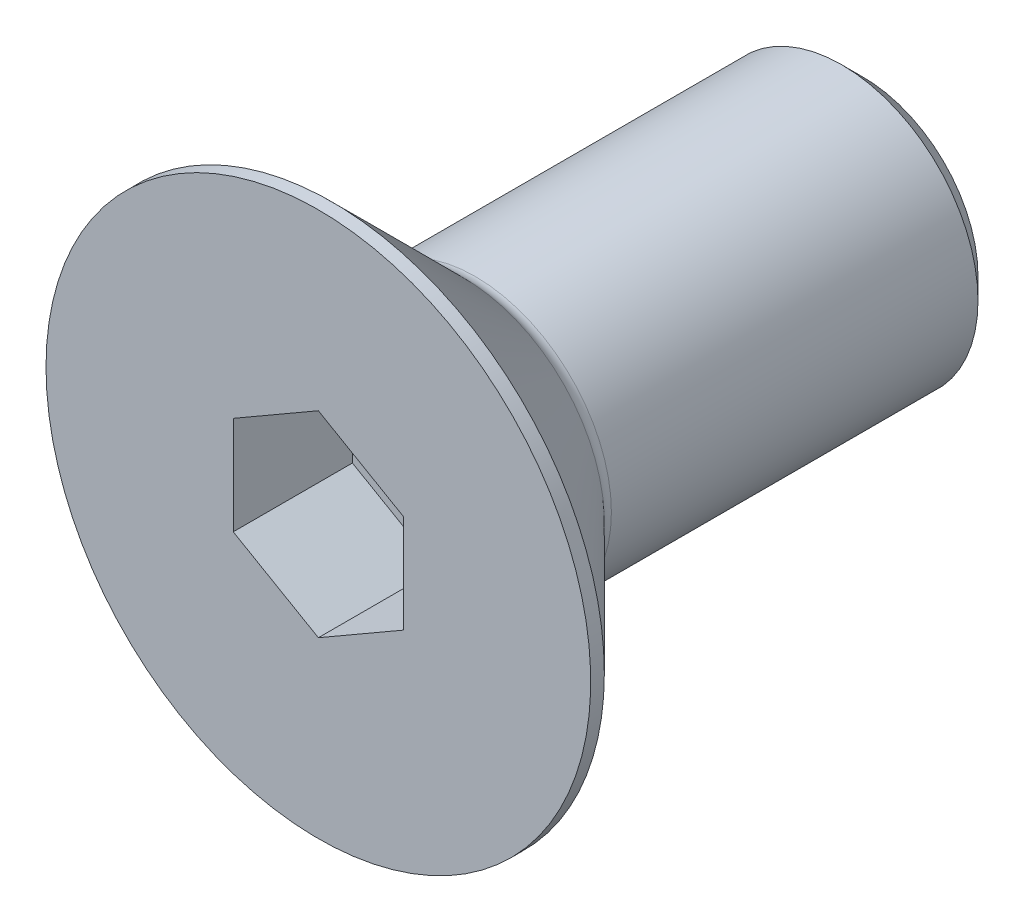
ISO-10303-21;
HEADER;
FILE_DESCRIPTION(('STEP AP214'),'2;1');
FILE_NAME('part.step','',(''),(''),'','','');
FILE_SCHEMA(('AUTOMOTIVE_DESIGN { 1 0 10303 214 1 1 1 1 }'));
ENDSEC;
DATA;
#1=APPLICATION_CONTEXT('core data for automotive mechanical design processes');
#2=APPLICATION_PROTOCOL_DEFINITION('international standard','automotive_design',2000,#1);
#3=PRODUCT_CONTEXT('',#1,'mechanical');
#4=PRODUCT('Part','Part','',(#3));
#5=PRODUCT_RELATED_PRODUCT_CATEGORY('part','',(#4));
#6=PRODUCT_DEFINITION_FORMATION('','',#4);
#7=PRODUCT_DEFINITION_CONTEXT('part definition',#1,'design');
#8=PRODUCT_DEFINITION('design','',#6,#7);
#9=PRODUCT_DEFINITION_SHAPE('','',#8);
#10=(LENGTH_UNIT() NAMED_UNIT(*) SI_UNIT(.MILLI.,.METRE.));
#11=(NAMED_UNIT(*) PLANE_ANGLE_UNIT() SI_UNIT($,.RADIAN.));
#12=(NAMED_UNIT(*) SI_UNIT($,.STERADIAN.) SOLID_ANGLE_UNIT());
#13=UNCERTAINTY_MEASURE_WITH_UNIT(LENGTH_MEASURE(1.E-05),#10,'distance_accuracy_value','');
#14=(GEOMETRIC_REPRESENTATION_CONTEXT(3) GLOBAL_UNCERTAINTY_ASSIGNED_CONTEXT((#13)) GLOBAL_UNIT_ASSIGNED_CONTEXT((#10,
#11,#12)) REPRESENTATION_CONTEXT('',''));
#15=CARTESIAN_POINT('',(0.,0.,0.));
#16=DIRECTION('',(0.,0.,1.));
#17=DIRECTION('',(1.,0.,0.));
#18=AXIS2_PLACEMENT_3D('',#15,#16,#17);
#19=CARTESIAN_POINT('',(0.,0.,-3.5));
#20=DIRECTION('',(0.,0.,1.));
#21=DIRECTION('',(1.,0.,0.));
#22=AXIS2_PLACEMENT_3D('',#19,#20,#21);
#23=PLANE('',#22);
#24=DIRECTION('',(-0.866025403784439,-0.5,0.));
#25=VECTOR('',#24,1.);
#26=CARTESIAN_POINT('',(0.,2.88675134594813,-3.5));
#27=LINE('',#26,#25);
#28=CARTESIAN_POINT('',(0.,2.88675134594813,-3.5));
#29=VERTEX_POINT('',#28);
#30=CARTESIAN_POINT('',(-2.5,1.44337567297406,-3.5));
#31=VERTEX_POINT('',#30);
#32=EDGE_CURVE('E82',#29,#31,#27,.T.);
#33=ORIENTED_EDGE('',*,*,#32,.T.);
#34=DIRECTION('',(0.,1.,0.));
#35=VECTOR('',#34,1.);
#36=CARTESIAN_POINT('',(-2.5,1.44337567297406,-3.5));
#37=LINE('',#36,#35);
#38=CARTESIAN_POINT('',(-2.5,-1.44337567297407,-3.5));
#39=VERTEX_POINT('',#38);
#40=EDGE_CURVE('E66',#31,#39,#37,.F.);
#41=ORIENTED_EDGE('',*,*,#40,.T.);
#42=DIRECTION('',(0.866025403784439,-0.499999999999999,0.));
#43=VECTOR('',#42,1.);
#44=CARTESIAN_POINT('',(-2.5,-1.44337567297407,-3.5));
#45=LINE('',#44,#43);
#46=CARTESIAN_POINT('',(0.,-2.88675134594813,-3.5));
#47=VERTEX_POINT('',#46);
#48=EDGE_CURVE('E71',#39,#47,#45,.T.);
#49=ORIENTED_EDGE('',*,*,#48,.T.);
#50=DIRECTION('',(0.866025403784439,0.5,0.));
#51=VECTOR('',#50,1.);
#52=CARTESIAN_POINT('',(0.,-2.88675134594813,-3.5));
#53=LINE('',#52,#51);
#54=CARTESIAN_POINT('',(2.5,-1.44337567297406,-3.5));
#55=VERTEX_POINT('',#54);
#56=EDGE_CURVE('E128',#47,#55,#53,.T.);
#57=ORIENTED_EDGE('',*,*,#56,.T.);
#58=DIRECTION('',(0.,1.,0.));
#59=VECTOR('',#58,1.);
#60=CARTESIAN_POINT('',(2.5,-1.44337567297406,-3.5));
#61=LINE('',#60,#59);
#62=CARTESIAN_POINT('',(2.5,1.44337567297407,-3.5));
#63=VERTEX_POINT('',#62);
#64=EDGE_CURVE('E132',#55,#63,#61,.T.);
#65=ORIENTED_EDGE('',*,*,#64,.T.);
#66=DIRECTION('',(-0.866025403784439,0.499999999999999,0.));
#67=VECTOR('',#66,1.);
#68=CARTESIAN_POINT('',(2.5,1.44337567297407,-3.5));
#69=LINE('',#68,#67);
#70=EDGE_CURVE('E137',#63,#29,#69,.T.);
#71=ORIENTED_EDGE('',*,*,#70,.T.);
#72=EDGE_LOOP('',(#33,#41,#49,#57,#65,#71));
#73=FACE_BOUND('',#72,.T.);
#74=ADVANCED_FACE('F15',(#73),#23,.T.);
#75=CARTESIAN_POINT('',(-2.5,-1.44337567297407,0.));
#76=DIRECTION('',(-0.499999999999999,-0.866025403784439,0.));
#77=DIRECTION('',(0.866025403784439,-0.499999999999999,0.));
#78=AXIS2_PLACEMENT_3D('',#75,#76,#77);
#79=PLANE('',#78);
#80=DIRECTION('',(0.,0.,1.));
#81=VECTOR('',#80,1.);
#82=CARTESIAN_POINT('',(-2.5,-1.44337567297407,0.));
#83=LINE('',#82,#81);
#84=CARTESIAN_POINT('',(-2.5,-1.44337567297407,0.));
#85=VERTEX_POINT('',#84);
#86=EDGE_CURVE('E73',#39,#85,#83,.T.);
#87=ORIENTED_EDGE('',*,*,#86,.T.);
#88=DIRECTION('',(-0.866025403784439,0.499999999999999,0.));
#89=VECTOR('',#88,1.);
#90=CARTESIAN_POINT('',(0.,-2.88675134594813,0.));
#91=LINE('',#90,#89);
#92=CARTESIAN_POINT('',(0.,-2.88675134594813,0.));
#93=VERTEX_POINT('',#92);
#94=EDGE_CURVE('E126',#93,#85,#91,.T.);
#95=ORIENTED_EDGE('',*,*,#94,.F.);
#96=DIRECTION('',(0.,0.,1.));
#97=VECTOR('',#96,1.);
#98=CARTESIAN_POINT('',(0.,-2.88675134594813,0.));
#99=LINE('',#98,#97);
#100=EDGE_CURVE('E76',#93,#47,#99,.F.);
#101=ORIENTED_EDGE('',*,*,#100,.T.);
#102=ORIENTED_EDGE('',*,*,#48,.F.);
#103=EDGE_LOOP('',(#87,#95,#101,#102));
#104=FACE_BOUND('',#103,.T.);
#105=ADVANCED_FACE('F72',(#104),#79,.F.);
#106=CARTESIAN_POINT('',(-2.5,1.44337567297406,0.));
#107=DIRECTION('',(-1.,0.,0.));
#108=DIRECTION('',(0.,0.,1.));
#109=AXIS2_PLACEMENT_3D('',#106,#107,#108);
#110=PLANE('',#109);
#111=DIRECTION('',(0.,0.,1.));
#112=VECTOR('',#111,1.);
#113=CARTESIAN_POINT('',(-2.5,1.44337567297406,0.));
#114=LINE('',#113,#112);
#115=CARTESIAN_POINT('',(-2.5,1.44337567297406,0.));
#116=VERTEX_POINT('',#115);
#117=EDGE_CURVE('E84',#31,#116,#114,.T.);
#118=ORIENTED_EDGE('',*,*,#117,.T.);
#119=DIRECTION('',(0.,1.,0.));
#120=VECTOR('',#119,1.);
#121=CARTESIAN_POINT('',(-2.5,0.,0.));
#122=LINE('',#121,#120);
#123=EDGE_CURVE('E88',#85,#116,#122,.T.);
#124=ORIENTED_EDGE('',*,*,#123,.F.);
#125=ORIENTED_EDGE('',*,*,#86,.F.);
#126=ORIENTED_EDGE('',*,*,#40,.F.);
#127=EDGE_LOOP('',(#118,#124,#125,#126));
#128=FACE_BOUND('',#127,.T.);
#129=ADVANCED_FACE('F86',(#128),#110,.F.);
#130=CARTESIAN_POINT('',(0.,2.88675134594813,0.));
#131=DIRECTION('',(-0.5,0.866025403784439,0.));
#132=DIRECTION('',(-0.866025403784439,-0.5,0.));
#133=AXIS2_PLACEMENT_3D('',#130,#131,#132);
#134=PLANE('',#133);
#135=DIRECTION('',(0.,0.,1.));
#136=VECTOR('',#135,1.);
#137=CARTESIAN_POINT('',(0.,2.88675134594813,0.));
#138=LINE('',#137,#136);
#139=CARTESIAN_POINT('',(0.,2.88675134594813,0.));
#140=VERTEX_POINT('',#139);
#141=EDGE_CURVE('E139',#29,#140,#138,.T.);
#142=ORIENTED_EDGE('',*,*,#141,.T.);
#143=DIRECTION('',(0.866025403784439,0.499999999999999,0.));
#144=VECTOR('',#143,1.);
#145=CARTESIAN_POINT('',(-2.5,1.44337567297406,0.));
#146=LINE('',#145,#144);
#147=EDGE_CURVE('E122',#116,#140,#146,.T.);
#148=ORIENTED_EDGE('',*,*,#147,.F.);
#149=ORIENTED_EDGE('',*,*,#117,.F.);
#150=ORIENTED_EDGE('',*,*,#32,.F.);
#151=EDGE_LOOP('',(#142,#148,#149,#150));
#152=FACE_BOUND('',#151,.T.);
#153=ADVANCED_FACE('F143',(#152),#134,.F.);
#154=CARTESIAN_POINT('',(2.5,1.44337567297407,0.));
#155=DIRECTION('',(0.499999999999999,0.866025403784439,0.));
#156=DIRECTION('',(-0.866025403784439,0.499999999999999,0.));
#157=AXIS2_PLACEMENT_3D('',#154,#155,#156);
#158=PLANE('',#157);
#159=DIRECTION('',(0.,0.,-1.));
#160=VECTOR('',#159,1.);
#161=CARTESIAN_POINT('',(2.5,1.44337567297407,0.));
#162=LINE('',#161,#160);
#163=CARTESIAN_POINT('',(2.5,1.44337567297407,0.));
#164=VERTEX_POINT('',#163);
#165=EDGE_CURVE('E135',#63,#164,#162,.F.);
#166=ORIENTED_EDGE('',*,*,#165,.T.);
#167=DIRECTION('',(0.866025403784439,-0.499999999999999,0.));
#168=VECTOR('',#167,1.);
#169=CARTESIAN_POINT('',(0.,2.88675134594813,0.));
#170=LINE('',#169,#168);
#171=EDGE_CURVE('E119',#140,#164,#170,.T.);
#172=ORIENTED_EDGE('',*,*,#171,.F.);
#173=ORIENTED_EDGE('',*,*,#141,.F.);
#174=ORIENTED_EDGE('',*,*,#70,.F.);
#175=EDGE_LOOP('',(#166,#172,#173,#174));
#176=FACE_BOUND('',#175,.T.);
#177=ADVANCED_FACE('F154',(#176),#158,.F.);
#178=CARTESIAN_POINT('',(2.5,-1.44337567297406,0.));
#179=DIRECTION('',(1.,0.,0.));
#180=DIRECTION('',(0.,0.,-1.));
#181=AXIS2_PLACEMENT_3D('',#178,#179,#180);
#182=PLANE('',#181);
#183=DIRECTION('',(0.,0.,1.));
#184=VECTOR('',#183,1.);
#185=CARTESIAN_POINT('',(2.5,-1.44337567297406,0.));
#186=LINE('',#185,#184);
#187=CARTESIAN_POINT('',(2.5,-1.44337567297406,0.));
#188=VERTEX_POINT('',#187);
#189=EDGE_CURVE('E34',#55,#188,#186,.T.);
#190=ORIENTED_EDGE('',*,*,#189,.T.);
#191=DIRECTION('',(0.,1.,0.));
#192=VECTOR('',#191,1.);
#193=CARTESIAN_POINT('',(2.5,0.,0.));
#194=LINE('',#193,#192);
#195=EDGE_CURVE('E116',#164,#188,#194,.F.);
#196=ORIENTED_EDGE('',*,*,#195,.F.);
#197=ORIENTED_EDGE('',*,*,#165,.F.);
#198=ORIENTED_EDGE('',*,*,#64,.F.);
#199=EDGE_LOOP('',(#190,#196,#197,#198));
#200=FACE_BOUND('',#199,.T.);
#201=ADVANCED_FACE('F152',(#200),#182,.F.);
#202=CARTESIAN_POINT('',(0.,-2.88675134594813,0.));
#203=DIRECTION('',(0.5,-0.866025403784439,0.));
#204=DIRECTION('',(0.866025403784439,0.5,0.));
#205=AXIS2_PLACEMENT_3D('',#202,#203,#204);
#206=PLANE('',#205);
#207=ORIENTED_EDGE('',*,*,#100,.F.);
#208=DIRECTION('',(-0.866025403784439,-0.499999999999999,0.));
#209=VECTOR('',#208,1.);
#210=CARTESIAN_POINT('',(2.5,-1.44337567297406,0.));
#211=LINE('',#210,#209);
#212=EDGE_CURVE('E113',#188,#93,#211,.T.);
#213=ORIENTED_EDGE('',*,*,#212,.F.);
#214=ORIENTED_EDGE('',*,*,#189,.F.);
#215=ORIENTED_EDGE('',*,*,#56,.F.);
#216=EDGE_LOOP('',(#207,#213,#214,#215));
#217=FACE_BOUND('',#216,.T.);
#218=ADVANCED_FACE('F150',(#217),#206,.F.);
#219=CARTESIAN_POINT('',(4.,0.,0.));
#220=DIRECTION('',(0.,0.,1.));
#221=DIRECTION('',(1.,0.,0.));
#222=AXIS2_PLACEMENT_3D('',#219,#220,#221);
#223=PLANE('',#222);
#224=ORIENTED_EDGE('',*,*,#195,.T.);
#225=ORIENTED_EDGE('',*,*,#212,.T.);
#226=ORIENTED_EDGE('',*,*,#94,.T.);
#227=ORIENTED_EDGE('',*,*,#123,.T.);
#228=ORIENTED_EDGE('',*,*,#147,.T.);
#229=ORIENTED_EDGE('',*,*,#171,.T.);
#230=EDGE_LOOP('',(#224,#225,#226,#227,#228,#229));
#231=FACE_BOUND('',#230,.T.);
#232=CARTESIAN_POINT('',(0.,0.,0.));
#233=DIRECTION('',(0.,0.,-1.));
#234=DIRECTION('',(-1.,0.,0.));
#235=AXIS2_PLACEMENT_3D('',#232,#233,#234);
#236=CIRCLE('',#235,8.);
#237=CARTESIAN_POINT('',(-8.,0.,0.));
#238=VERTEX_POINT('',#237);
#239=EDGE_CURVE('E19',#238,#238,#236,.T.);
#240=ORIENTED_EDGE('',*,*,#239,.F.);
#241=EDGE_LOOP('',(#240));
#242=FACE_BOUND('',#241,.T.);
#243=ADVANCED_FACE('F147',(#231,#242),#223,.T.);
#244=CARTESIAN_POINT('',(0.,0.,-0.2));
#245=DIRECTION('',(0.,0.,-1.));
#246=DIRECTION('',(-1.,0.,0.));
#247=AXIS2_PLACEMENT_3D('',#244,#245,#246);
#248=CYLINDRICAL_SURFACE('',#247,8.);
#249=ORIENTED_EDGE('',*,*,#239,.T.);
#250=EDGE_LOOP('',(#249));
#251=FACE_BOUND('',#250,.T.);
#252=CARTESIAN_POINT('',(0.,0.,-0.399999998251133));
#253=DIRECTION('',(0.,0.,1.));
#254=DIRECTION('',(1.,0.,0.));
#255=AXIS2_PLACEMENT_3D('',#252,#253,#254);
#256=CIRCLE('',#255,7.99999999821921);
#257=CARTESIAN_POINT('',(7.99999999821921,0.,-0.399999998251133));
#258=VERTEX_POINT('',#257);
#259=EDGE_CURVE('E100',#258,#258,#256,.F.);
#260=ORIENTED_EDGE('',*,*,#259,.F.);
#261=EDGE_LOOP('',(#260));
#262=FACE_BOUND('',#261,.T.);
#263=ADVANCED_FACE('F183',(#251,#262),#248,.T.);
#264=CARTESIAN_POINT('',(0.,0.,-0.399999998251133));
#265=DIRECTION('',(0.,0.,1.));
#266=DIRECTION('',(1.,0.,0.));
#267=AXIS2_PLACEMENT_3D('',#264,#265,#266);
#268=CONICAL_SURFACE('',#267,7.99999999821921,0.785398162505018);
#269=CARTESIAN_POINT('',(0.,0.,-4.25355339059328));
#270=DIRECTION('',(0.,0.,-1.));
#271=DIRECTION('',(-1.,0.,0.));
#272=AXIS2_PLACEMENT_3D('',#269,#270,#271);
#273=CIRCLE('',#272,4.14644660940673);
#274=CARTESIAN_POINT('',(-4.14644660940673,0.,-4.25355339059328));
#275=VERTEX_POINT('',#274);
#276=EDGE_CURVE('E94',#275,#275,#273,.T.);
#277=ORIENTED_EDGE('',*,*,#276,.F.);
#278=EDGE_LOOP('',(#277));
#279=FACE_BOUND('',#278,.T.);
#280=ORIENTED_EDGE('',*,*,#259,.T.);
#281=EDGE_LOOP('',(#280));
#282=FACE_BOUND('',#281,.T.);
#283=ADVANCED_FACE('F179',(#279,#282),#268,.T.);
#284=CARTESIAN_POINT('',(2.,0.,-16.));
#285=DIRECTION('',(0.,0.,-1.));
#286=DIRECTION('',(-1.,0.,0.));
#287=AXIS2_PLACEMENT_3D('',#284,#285,#286);
#288=PLANE('',#287);
#289=CARTESIAN_POINT('',(0.,0.,-16.0000000002469));
#290=DIRECTION('',(0.,0.,1.));
#291=DIRECTION('',(1.,0.,0.));
#292=AXIS2_PLACEMENT_3D('',#289,#290,#291);
#293=CIRCLE('',#292,3.37500000028967);
#294=CARTESIAN_POINT('',(3.37500000028967,0.,-16.0000000002469));
#295=VERTEX_POINT('',#294);
#296=EDGE_CURVE('E92',#295,#295,#293,.T.);
#297=ORIENTED_EDGE('',*,*,#296,.F.);
#298=EDGE_LOOP('',(#297));
#299=FACE_BOUND('',#298,.T.);
#300=ADVANCED_FACE('F176',(#299),#288,.T.);
#301=CARTESIAN_POINT('',(0.,0.,-4.60710678118655));
#302=DIRECTION('',(0.,0.,-1.));
#303=DIRECTION('',(-1.,0.,0.));
#304=AXIS2_PLACEMENT_3D('',#301,#302,#303);
#305=TOROIDAL_SURFACE('',#304,4.5,0.5);
#306=CARTESIAN_POINT('',(0.,0.,-4.60710678118655));
#307=DIRECTION('',(0.,0.,-1.));
#308=DIRECTION('',(-1.,0.,0.));
#309=AXIS2_PLACEMENT_3D('',#306,#307,#308);
#310=CIRCLE('',#309,4.);
#311=CARTESIAN_POINT('',(-4.,0.,-4.60710678118655));
#312=VERTEX_POINT('',#311);
#313=EDGE_CURVE('E25',#312,#312,#310,.T.);
#314=ORIENTED_EDGE('',*,*,#313,.F.);
#315=EDGE_LOOP('',(#314));
#316=FACE_BOUND('',#315,.T.);
#317=ORIENTED_EDGE('',*,*,#276,.T.);
#318=EDGE_LOOP('',(#317));
#319=FACE_BOUND('',#318,.T.);
#320=ADVANCED_FACE('F17',(#316,#319),#305,.F.);
#321=CARTESIAN_POINT('',(0.,0.,-15.3749999997785));
#322=DIRECTION('',(0.,0.,1.));
#323=DIRECTION('',(1.,0.,0.));
#324=AXIS2_PLACEMENT_3D('',#321,#322,#323);
#325=CONICAL_SURFACE('',#324,3.9999999996212,0.785398162487954);
#326=ORIENTED_EDGE('',*,*,#296,.T.);
#327=EDGE_LOOP('',(#326));
#328=FACE_BOUND('',#327,.T.);
#329=CARTESIAN_POINT('',(0.,0.,-15.375));
#330=DIRECTION('',(0.,0.,-1.));
#331=DIRECTION('',(-1.,0.,0.));
#332=AXIS2_PLACEMENT_3D('',#329,#330,#331);
#333=CIRCLE('',#332,4.);
#334=CARTESIAN_POINT('',(-4.,0.,-15.375));
#335=VERTEX_POINT('',#334);
#336=EDGE_CURVE('E9',#335,#335,#333,.F.);
#337=ORIENTED_EDGE('',*,*,#336,.F.);
#338=EDGE_LOOP('',(#337));
#339=FACE_BOUND('',#338,.T.);
#340=ADVANCED_FACE('F166',(#328,#339),#325,.T.);
#341=CARTESIAN_POINT('',(0.,0.,-10.2));
#342=DIRECTION('',(0.,0.,-1.));
#343=DIRECTION('',(-1.,0.,0.));
#344=AXIS2_PLACEMENT_3D('',#341,#342,#343);
#345=CYLINDRICAL_SURFACE('',#344,4.);
#346=ORIENTED_EDGE('',*,*,#336,.T.);
#347=EDGE_LOOP('',(#346));
#348=FACE_BOUND('',#347,.T.);
#349=ORIENTED_EDGE('',*,*,#313,.T.);
#350=EDGE_LOOP('',(#349));
#351=FACE_BOUND('',#350,.T.);
#352=ADVANCED_FACE('F164',(#348,#351),#345,.T.);
#353=CLOSED_SHELL('',(#74,#105,#129,#153,#177,#201,#218,#243,#263,#283,#300,#320,#340,#352));
#354=MANIFOLD_SOLID_BREP('B1',#353);
#355=ADVANCED_BREP_SHAPE_REPRESENTATION('',(#18,#354),#14);
#356=SHAPE_DEFINITION_REPRESENTATION(#9,#355);
ENDSEC;
END-ISO-10303-21;
